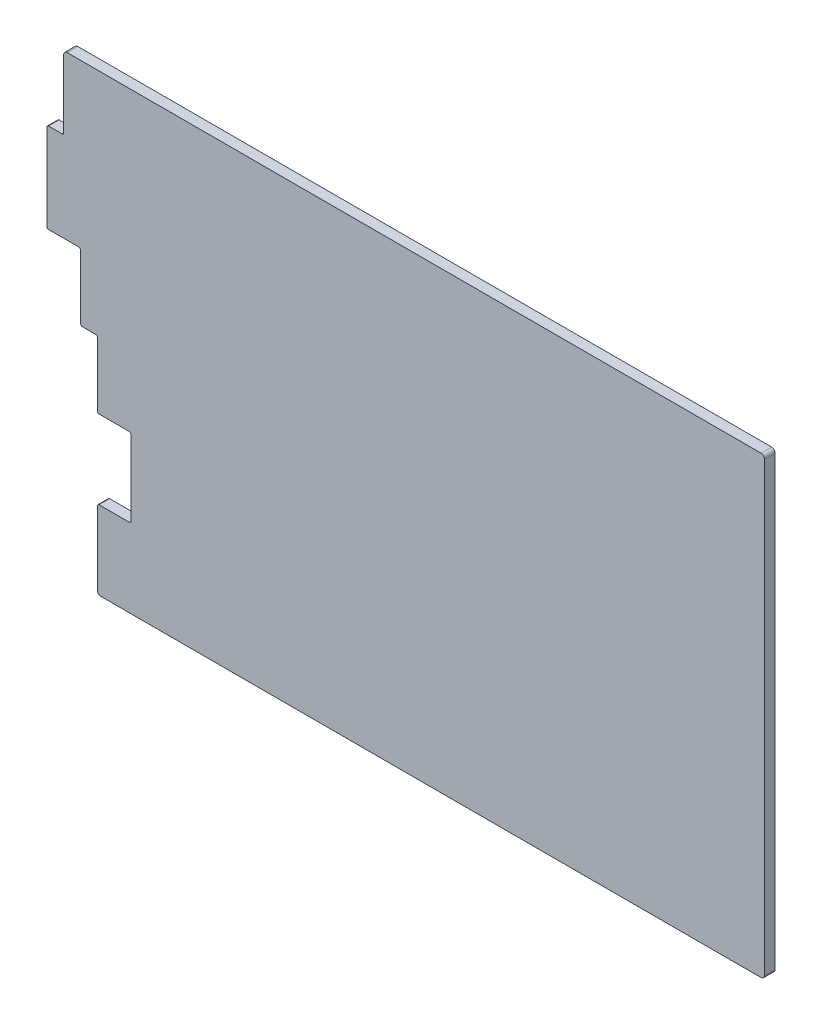
ISO-10303-21;
HEADER;
FILE_DESCRIPTION(('STEP AP214'),'2;1');
FILE_NAME('part.step','',(''),(''),'','','');
FILE_SCHEMA(('AUTOMOTIVE_DESIGN { 1 0 10303 214 1 1 1 1 }'));
ENDSEC;
DATA;
#1=APPLICATION_CONTEXT('core data for automotive mechanical design processes');
#2=APPLICATION_PROTOCOL_DEFINITION('international standard','automotive_design',2000,#1);
#3=PRODUCT_CONTEXT('',#1,'mechanical');
#4=PRODUCT('Part','Part','',(#3));
#5=PRODUCT_RELATED_PRODUCT_CATEGORY('part','',(#4));
#6=PRODUCT_DEFINITION_FORMATION('','',#4);
#7=PRODUCT_DEFINITION_CONTEXT('part definition',#1,'design');
#8=PRODUCT_DEFINITION('design','',#6,#7);
#9=PRODUCT_DEFINITION_SHAPE('','',#8);
#10=(LENGTH_UNIT() NAMED_UNIT(*) SI_UNIT(.MILLI.,.METRE.));
#11=(NAMED_UNIT(*) PLANE_ANGLE_UNIT() SI_UNIT($,.RADIAN.));
#12=(NAMED_UNIT(*) SI_UNIT($,.STERADIAN.) SOLID_ANGLE_UNIT());
#13=UNCERTAINTY_MEASURE_WITH_UNIT(LENGTH_MEASURE(1.E-05),#10,'distance_accuracy_value','');
#14=(GEOMETRIC_REPRESENTATION_CONTEXT(3) GLOBAL_UNCERTAINTY_ASSIGNED_CONTEXT((#13)) GLOBAL_UNIT_ASSIGNED_CONTEXT((#10,
#11,#12)) REPRESENTATION_CONTEXT('',''));
#15=CARTESIAN_POINT('',(0.,0.,0.));
#16=DIRECTION('',(0.,0.,1.));
#17=DIRECTION('',(1.,0.,0.));
#18=AXIS2_PLACEMENT_3D('',#15,#16,#17);
#19=CARTESIAN_POINT('',(6.45693000000005,0.,3.));
#20=DIRECTION('',(-1.,0.,0.));
#21=DIRECTION('',(0.,-1.,0.));
#22=AXIS2_PLACEMENT_3D('',#19,#20,#21);
#23=PLANE('',#22);
#24=DIRECTION('',(0.,1.,0.));
#25=VECTOR('',#24,1.);
#26=CARTESIAN_POINT('',(6.45693000000005,0.,3.));
#27=LINE('',#26,#25);
#28=CARTESIAN_POINT('',(6.45693000000002,108.871,3.));
#29=VERTEX_POINT('',#28);
#30=CARTESIAN_POINT('',(6.45693000000001,128.021,3.));
#31=VERTEX_POINT('',#30);
#32=EDGE_CURVE('E269',#29,#31,#27,.T.);
#33=ORIENTED_EDGE('',*,*,#32,.T.);
#34=DIRECTION('',(0.,0.,-1.));
#35=VECTOR('',#34,1.);
#36=CARTESIAN_POINT('',(6.45693000000001,128.021,3.));
#37=LINE('',#36,#35);
#38=CARTESIAN_POINT('',(6.45693000000001,128.021,0.));
#39=VERTEX_POINT('',#38);
#40=EDGE_CURVE('E372',#31,#39,#37,.T.);
#41=ORIENTED_EDGE('',*,*,#40,.T.);
#42=DIRECTION('',(0.,1.,0.));
#43=VECTOR('',#42,1.);
#44=CARTESIAN_POINT('',(6.45693000000005,0.,0.));
#45=LINE('',#44,#43);
#46=CARTESIAN_POINT('',(6.45693000000002,108.871,0.));
#47=VERTEX_POINT('',#46);
#48=EDGE_CURVE('E402',#47,#39,#45,.T.);
#49=ORIENTED_EDGE('',*,*,#48,.F.);
#50=DIRECTION('',(0.,0.,-1.));
#51=VECTOR('',#50,1.);
#52=CARTESIAN_POINT('',(6.45693000000002,108.871,3.));
#53=LINE('',#52,#51);
#54=EDGE_CURVE('E330',#47,#29,#53,.F.);
#55=ORIENTED_EDGE('',*,*,#54,.T.);
#56=EDGE_LOOP('',(#33,#41,#49,#55));
#57=FACE_BOUND('',#56,.T.);
#58=ADVANCED_FACE('F43',(#57),#23,.T.);
#59=CARTESIAN_POINT('',(0.,108.371,3.));
#60=DIRECTION('',(0.,1.,0.));
#61=DIRECTION('',(0.,0.,1.));
#62=AXIS2_PLACEMENT_3D('',#59,#60,#61);
#63=PLANE('',#62);
#64=DIRECTION('',(1.,0.,0.));
#65=VECTOR('',#64,1.);
#66=CARTESIAN_POINT('',(0.,108.371,0.));
#67=LINE('',#66,#65);
#68=CARTESIAN_POINT('',(2.19393000000002,108.371,0.));
#69=VERTEX_POINT('',#68);
#70=CARTESIAN_POINT('',(5.95693000000002,108.371,0.));
#71=VERTEX_POINT('',#70);
#72=EDGE_CURVE('E405',#69,#71,#67,.T.);
#73=ORIENTED_EDGE('',*,*,#72,.F.);
#74=DIRECTION('',(0.,0.,-1.));
#75=VECTOR('',#74,1.);
#76=CARTESIAN_POINT('',(2.19393000000002,108.371,3.));
#77=LINE('',#76,#75);
#78=CARTESIAN_POINT('',(2.19393000000002,108.371,3.));
#79=VERTEX_POINT('',#78);
#80=EDGE_CURVE('E328',#69,#79,#77,.F.);
#81=ORIENTED_EDGE('',*,*,#80,.T.);
#82=DIRECTION('',(1.,0.,0.));
#83=VECTOR('',#82,1.);
#84=CARTESIAN_POINT('',(0.,108.371,3.));
#85=LINE('',#84,#83);
#86=CARTESIAN_POINT('',(5.95693000000002,108.371,3.));
#87=VERTEX_POINT('',#86);
#88=EDGE_CURVE('E526',#79,#87,#85,.T.);
#89=ORIENTED_EDGE('',*,*,#88,.T.);
#90=DIRECTION('',(0.,0.,-1.));
#91=VECTOR('',#90,1.);
#92=CARTESIAN_POINT('',(5.95693000000002,108.371,0.));
#93=LINE('',#92,#91);
#94=EDGE_CURVE('E325',#87,#71,#93,.T.);
#95=ORIENTED_EDGE('',*,*,#94,.T.);
#96=EDGE_LOOP('',(#73,#81,#89,#95));
#97=FACE_BOUND('',#96,.T.);
#98=ADVANCED_FACE('F473',(#97),#63,.T.);
#99=CARTESIAN_POINT('',(1.69393000000002,0.,3.));
#100=DIRECTION('',(-1.,0.,0.));
#101=DIRECTION('',(0.,0.,1.));
#102=AXIS2_PLACEMENT_3D('',#99,#100,#101);
#103=PLANE('',#102);
#104=DIRECTION('',(0.,1.,0.));
#105=VECTOR('',#104,1.);
#106=CARTESIAN_POINT('',(1.69393000000002,0.,0.));
#107=LINE('',#106,#105);
#108=CARTESIAN_POINT('',(1.69393000000002,83.491,0.));
#109=VERTEX_POINT('',#108);
#110=CARTESIAN_POINT('',(1.69393000000002,107.871,0.));
#111=VERTEX_POINT('',#110);
#112=EDGE_CURVE('E408',#109,#111,#107,.T.);
#113=ORIENTED_EDGE('',*,*,#112,.F.);
#114=DIRECTION('',(0.,0.,-1.));
#115=VECTOR('',#114,1.);
#116=CARTESIAN_POINT('',(1.69393000000002,83.491,3.));
#117=LINE('',#116,#115);
#118=CARTESIAN_POINT('',(1.69393000000002,83.491,3.));
#119=VERTEX_POINT('',#118);
#120=EDGE_CURVE('E323',#109,#119,#117,.F.);
#121=ORIENTED_EDGE('',*,*,#120,.T.);
#122=DIRECTION('',(0.,1.,0.));
#123=VECTOR('',#122,1.);
#124=CARTESIAN_POINT('',(1.69393000000002,0.,3.));
#125=LINE('',#124,#123);
#126=CARTESIAN_POINT('',(1.69393000000002,107.871,3.));
#127=VERTEX_POINT('',#126);
#128=EDGE_CURVE('E523',#119,#127,#125,.T.);
#129=ORIENTED_EDGE('',*,*,#128,.T.);
#130=DIRECTION('',(0.,0.,-1.));
#131=VECTOR('',#130,1.);
#132=CARTESIAN_POINT('',(1.69393000000002,107.871,3.));
#133=LINE('',#132,#131);
#134=EDGE_CURVE('E320',#127,#111,#133,.T.);
#135=ORIENTED_EDGE('',*,*,#134,.T.);
#136=EDGE_LOOP('',(#113,#121,#129,#135));
#137=FACE_BOUND('',#136,.T.);
#138=ADVANCED_FACE('F480',(#137),#103,.T.);
#139=CARTESIAN_POINT('',(0.,82.991,3.));
#140=DIRECTION('',(0.,1.,0.));
#141=DIRECTION('',(0.,0.,1.));
#142=AXIS2_PLACEMENT_3D('',#139,#140,#141);
#143=PLANE('',#142);
#144=DIRECTION('',(1.,0.,0.));
#145=VECTOR('',#144,1.);
#146=CARTESIAN_POINT('',(0.,82.991,3.));
#147=LINE('',#146,#145);
#148=CARTESIAN_POINT('',(2.19393000000002,82.991,3.));
#149=VERTEX_POINT('',#148);
#150=CARTESIAN_POINT('',(10.71893,82.991,3.));
#151=VERTEX_POINT('',#150);
#152=EDGE_CURVE('E530',#149,#151,#147,.T.);
#153=ORIENTED_EDGE('',*,*,#152,.F.);
#154=DIRECTION('',(0.,0.,-1.));
#155=VECTOR('',#154,1.);
#156=CARTESIAN_POINT('',(2.19393000000002,82.991,0.));
#157=LINE('',#156,#155);
#158=CARTESIAN_POINT('',(2.19393000000002,82.991,0.));
#159=VERTEX_POINT('',#158);
#160=EDGE_CURVE('E317',#149,#159,#157,.T.);
#161=ORIENTED_EDGE('',*,*,#160,.T.);
#162=DIRECTION('',(1.,0.,0.));
#163=VECTOR('',#162,1.);
#164=CARTESIAN_POINT('',(0.,82.991,0.));
#165=LINE('',#164,#163);
#166=CARTESIAN_POINT('',(10.71893,82.991,0.));
#167=VERTEX_POINT('',#166);
#168=EDGE_CURVE('E411',#159,#167,#165,.T.);
#169=ORIENTED_EDGE('',*,*,#168,.T.);
#170=DIRECTION('',(0.,0.,-1.));
#171=VECTOR('',#170,1.);
#172=CARTESIAN_POINT('',(10.71893,82.991,3.));
#173=LINE('',#172,#171);
#174=EDGE_CURVE('E315',#167,#151,#173,.F.);
#175=ORIENTED_EDGE('',*,*,#174,.T.);
#176=EDGE_LOOP('',(#153,#161,#169,#175));
#177=FACE_BOUND('',#176,.T.);
#178=ADVANCED_FACE('F579',(#177),#143,.F.);
#179=CARTESIAN_POINT('',(11.21893,0.,3.));
#180=DIRECTION('',(1.,0.,0.));
#181=DIRECTION('',(0.,1.,0.));
#182=AXIS2_PLACEMENT_3D('',#179,#180,#181);
#183=PLANE('',#182);
#184=DIRECTION('',(0.,-1.,0.));
#185=VECTOR('',#184,1.);
#186=CARTESIAN_POINT('',(11.21893,0.,0.));
#187=LINE('',#186,#185);
#188=CARTESIAN_POINT('',(11.21893,82.491,0.));
#189=VERTEX_POINT('',#188);
#190=CARTESIAN_POINT('',(11.21893,64.441,0.));
#191=VERTEX_POINT('',#190);
#192=EDGE_CURVE('E414',#189,#191,#187,.T.);
#193=ORIENTED_EDGE('',*,*,#192,.T.);
#194=DIRECTION('',(0.,0.,-1.));
#195=VECTOR('',#194,1.);
#196=CARTESIAN_POINT('',(11.21893,64.441,3.));
#197=LINE('',#196,#195);
#198=CARTESIAN_POINT('',(11.21893,64.441,3.));
#199=VERTEX_POINT('',#198);
#200=EDGE_CURVE('E313',#191,#199,#197,.F.);
#201=ORIENTED_EDGE('',*,*,#200,.T.);
#202=DIRECTION('',(0.,-1.,0.));
#203=VECTOR('',#202,1.);
#204=CARTESIAN_POINT('',(11.21893,0.,3.));
#205=LINE('',#204,#203);
#206=CARTESIAN_POINT('',(11.21893,82.491,3.));
#207=VERTEX_POINT('',#206);
#208=EDGE_CURVE('E533',#207,#199,#205,.T.);
#209=ORIENTED_EDGE('',*,*,#208,.F.);
#210=DIRECTION('',(0.,0.,-1.));
#211=VECTOR('',#210,1.);
#212=CARTESIAN_POINT('',(11.21893,82.491,0.));
#213=LINE('',#212,#211);
#214=EDGE_CURVE('E310',#207,#189,#213,.T.);
#215=ORIENTED_EDGE('',*,*,#214,.T.);
#216=EDGE_LOOP('',(#193,#201,#209,#215));
#217=FACE_BOUND('',#216,.T.);
#218=ADVANCED_FACE('F571',(#217),#183,.F.);
#219=CARTESIAN_POINT('',(0.,63.941,3.));
#220=DIRECTION('',(0.,1.,0.));
#221=DIRECTION('',(0.,0.,1.));
#222=AXIS2_PLACEMENT_3D('',#219,#220,#221);
#223=PLANE('',#222);
#224=DIRECTION('',(1.,0.,0.));
#225=VECTOR('',#224,1.);
#226=CARTESIAN_POINT('',(0.,63.941,0.));
#227=LINE('',#226,#225);
#228=CARTESIAN_POINT('',(11.71893,63.941,0.));
#229=VERTEX_POINT('',#228);
#230=CARTESIAN_POINT('',(15.48193,63.941,0.));
#231=VERTEX_POINT('',#230);
#232=EDGE_CURVE('E417',#229,#231,#227,.T.);
#233=ORIENTED_EDGE('',*,*,#232,.T.);
#234=DIRECTION('',(0.,0.,-1.));
#235=VECTOR('',#234,1.);
#236=CARTESIAN_POINT('',(15.48193,63.941,3.));
#237=LINE('',#236,#235);
#238=CARTESIAN_POINT('',(15.48193,63.941,3.));
#239=VERTEX_POINT('',#238);
#240=EDGE_CURVE('E308',#231,#239,#237,.F.);
#241=ORIENTED_EDGE('',*,*,#240,.T.);
#242=DIRECTION('',(1.,0.,0.));
#243=VECTOR('',#242,1.);
#244=CARTESIAN_POINT('',(0.,63.941,3.));
#245=LINE('',#244,#243);
#246=CARTESIAN_POINT('',(11.71893,63.941,3.));
#247=VERTEX_POINT('',#246);
#248=EDGE_CURVE('E540',#247,#239,#245,.T.);
#249=ORIENTED_EDGE('',*,*,#248,.F.);
#250=DIRECTION('',(0.,0.,-1.));
#251=VECTOR('',#250,1.);
#252=CARTESIAN_POINT('',(11.71893,63.941,3.));
#253=LINE('',#252,#251);
#254=EDGE_CURVE('E305',#247,#229,#253,.T.);
#255=ORIENTED_EDGE('',*,*,#254,.T.);
#256=EDGE_LOOP('',(#233,#241,#249,#255));
#257=FACE_BOUND('',#256,.T.);
#258=ADVANCED_FACE('F564',(#257),#223,.F.);
#259=CARTESIAN_POINT('',(15.98193,0.,3.));
#260=DIRECTION('',(1.,0.,0.));
#261=DIRECTION('',(0.,1.,0.));
#262=AXIS2_PLACEMENT_3D('',#259,#260,#261);
#263=PLANE('',#262);
#264=DIRECTION('',(0.,-1.,0.));
#265=VECTOR('',#264,1.);
#266=CARTESIAN_POINT('',(15.98193,0.,0.));
#267=LINE('',#266,#265);
#268=CARTESIAN_POINT('',(15.98193,63.441,0.));
#269=VERTEX_POINT('',#268);
#270=CARTESIAN_POINT('',(15.98193,45.391,0.));
#271=VERTEX_POINT('',#270);
#272=EDGE_CURVE('E420',#269,#271,#267,.T.);
#273=ORIENTED_EDGE('',*,*,#272,.T.);
#274=DIRECTION('',(0.,0.,-1.));
#275=VECTOR('',#274,1.);
#276=CARTESIAN_POINT('',(15.98193,45.391,3.));
#277=LINE('',#276,#275);
#278=CARTESIAN_POINT('',(15.98193,45.391,3.));
#279=VERTEX_POINT('',#278);
#280=EDGE_CURVE('E303',#271,#279,#277,.F.);
#281=ORIENTED_EDGE('',*,*,#280,.T.);
#282=DIRECTION('',(0.,-1.,0.));
#283=VECTOR('',#282,1.);
#284=CARTESIAN_POINT('',(15.98193,0.,3.));
#285=LINE('',#284,#283);
#286=CARTESIAN_POINT('',(15.98193,63.441,3.));
#287=VERTEX_POINT('',#286);
#288=EDGE_CURVE('E543',#287,#279,#285,.T.);
#289=ORIENTED_EDGE('',*,*,#288,.F.);
#290=DIRECTION('',(0.,0.,-1.));
#291=VECTOR('',#290,1.);
#292=CARTESIAN_POINT('',(15.98193,63.441,0.));
#293=LINE('',#292,#291);
#294=EDGE_CURVE('E300',#287,#269,#293,.T.);
#295=ORIENTED_EDGE('',*,*,#294,.T.);
#296=EDGE_LOOP('',(#273,#281,#289,#295));
#297=FACE_BOUND('',#296,.T.);
#298=ADVANCED_FACE('F557',(#297),#263,.F.);
#299=CARTESIAN_POINT('',(0.,44.891,3.));
#300=DIRECTION('',(0.,1.,0.));
#301=DIRECTION('',(0.,0.,1.));
#302=AXIS2_PLACEMENT_3D('',#299,#300,#301);
#303=PLANE('',#302);
#304=DIRECTION('',(1.,0.,0.));
#305=VECTOR('',#304,1.);
#306=CARTESIAN_POINT('',(0.,44.891,3.));
#307=LINE('',#306,#305);
#308=CARTESIAN_POINT('',(16.48193,44.891,3.));
#309=VERTEX_POINT('',#308);
#310=CARTESIAN_POINT('',(25.00693,44.891,3.));
#311=VERTEX_POINT('',#310);
#312=EDGE_CURVE('E446',#309,#311,#307,.T.);
#313=ORIENTED_EDGE('',*,*,#312,.F.);
#314=DIRECTION('',(0.,0.,-1.));
#315=VECTOR('',#314,1.);
#316=CARTESIAN_POINT('',(16.48193,44.891,3.));
#317=LINE('',#316,#315);
#318=CARTESIAN_POINT('',(16.48193,44.891,0.));
#319=VERTEX_POINT('',#318);
#320=EDGE_CURVE('E297',#309,#319,#317,.T.);
#321=ORIENTED_EDGE('',*,*,#320,.T.);
#322=DIRECTION('',(1.,0.,0.));
#323=VECTOR('',#322,1.);
#324=CARTESIAN_POINT('',(0.,44.891,0.));
#325=LINE('',#324,#323);
#326=CARTESIAN_POINT('',(25.00693,44.891,0.));
#327=VERTEX_POINT('',#326);
#328=EDGE_CURVE('E423',#319,#327,#325,.T.);
#329=ORIENTED_EDGE('',*,*,#328,.T.);
#330=DIRECTION('',(0.,0.,-1.));
#331=VECTOR('',#330,1.);
#332=CARTESIAN_POINT('',(25.00693,44.891,3.));
#333=LINE('',#332,#331);
#334=EDGE_CURVE('E295',#327,#311,#333,.F.);
#335=ORIENTED_EDGE('',*,*,#334,.T.);
#336=EDGE_LOOP('',(#313,#321,#329,#335));
#337=FACE_BOUND('',#336,.T.);
#338=ADVANCED_FACE('F553',(#337),#303,.F.);
#339=CARTESIAN_POINT('',(25.50693,0.,3.));
#340=DIRECTION('',(1.,0.,0.));
#341=DIRECTION('',(0.,1.,0.));
#342=AXIS2_PLACEMENT_3D('',#339,#340,#341);
#343=PLANE('',#342);
#344=DIRECTION('',(0.,-1.,0.));
#345=VECTOR('',#344,1.);
#346=CARTESIAN_POINT('',(25.50693,0.,0.));
#347=LINE('',#346,#345);
#348=CARTESIAN_POINT('',(25.50693,44.391,0.));
#349=VERTEX_POINT('',#348);
#350=CARTESIAN_POINT('',(25.50693,23.141,0.));
#351=VERTEX_POINT('',#350);
#352=EDGE_CURVE('E261',#349,#351,#347,.T.);
#353=ORIENTED_EDGE('',*,*,#352,.T.);
#354=DIRECTION('',(0.,0.,-1.));
#355=VECTOR('',#354,1.);
#356=CARTESIAN_POINT('',(25.50693,23.141,3.));
#357=LINE('',#356,#355);
#358=CARTESIAN_POINT('',(25.50693,23.141,3.));
#359=VERTEX_POINT('',#358);
#360=EDGE_CURVE('E293',#351,#359,#357,.F.);
#361=ORIENTED_EDGE('',*,*,#360,.T.);
#362=DIRECTION('',(0.,-1.,0.));
#363=VECTOR('',#362,1.);
#364=CARTESIAN_POINT('',(25.50693,0.,3.));
#365=LINE('',#364,#363);
#366=CARTESIAN_POINT('',(25.50693,44.391,3.));
#367=VERTEX_POINT('',#366);
#368=EDGE_CURVE('E441',#367,#359,#365,.T.);
#369=ORIENTED_EDGE('',*,*,#368,.F.);
#370=DIRECTION('',(0.,0.,-1.));
#371=VECTOR('',#370,1.);
#372=CARTESIAN_POINT('',(25.50693,44.391,0.));
#373=LINE('',#372,#371);
#374=EDGE_CURVE('E290',#367,#349,#373,.T.);
#375=ORIENTED_EDGE('',*,*,#374,.T.);
#376=EDGE_LOOP('',(#353,#361,#369,#375));
#377=FACE_BOUND('',#376,.T.);
#378=ADVANCED_FACE('F429',(#377),#343,.F.);
#379=CARTESIAN_POINT('',(0.,22.641,3.));
#380=DIRECTION('',(0.,-1.,0.));
#381=DIRECTION('',(0.,0.,-1.));
#382=AXIS2_PLACEMENT_3D('',#379,#380,#381);
#383=PLANE('',#382);
#384=DIRECTION('',(-1.,0.,0.));
#385=VECTOR('',#384,1.);
#386=CARTESIAN_POINT('',(0.,22.641,0.));
#387=LINE('',#386,#385);
#388=CARTESIAN_POINT('',(25.00693,22.641,0.));
#389=VERTEX_POINT('',#388);
#390=CARTESIAN_POINT('',(16.48193,22.641,0.));
#391=VERTEX_POINT('',#390);
#392=EDGE_CURVE('E257',#389,#391,#387,.T.);
#393=ORIENTED_EDGE('',*,*,#392,.T.);
#394=DIRECTION('',(0.,0.,-1.));
#395=VECTOR('',#394,1.);
#396=CARTESIAN_POINT('',(16.48193,22.641,3.));
#397=LINE('',#396,#395);
#398=CARTESIAN_POINT('',(16.48193,22.641,3.));
#399=VERTEX_POINT('',#398);
#400=EDGE_CURVE('E234',#391,#399,#397,.F.);
#401=ORIENTED_EDGE('',*,*,#400,.T.);
#402=DIRECTION('',(-1.,0.,0.));
#403=VECTOR('',#402,1.);
#404=CARTESIAN_POINT('',(0.,22.641,3.));
#405=LINE('',#404,#403);
#406=CARTESIAN_POINT('',(25.00693,22.641,3.));
#407=VERTEX_POINT('',#406);
#408=EDGE_CURVE('E440',#407,#399,#405,.T.);
#409=ORIENTED_EDGE('',*,*,#408,.F.);
#410=DIRECTION('',(0.,0.,-1.));
#411=VECTOR('',#410,1.);
#412=CARTESIAN_POINT('',(25.00693,22.641,0.));
#413=LINE('',#412,#411);
#414=EDGE_CURVE('E239',#407,#389,#413,.T.);
#415=ORIENTED_EDGE('',*,*,#414,.T.);
#416=EDGE_LOOP('',(#393,#401,#409,#415));
#417=FACE_BOUND('',#416,.T.);
#418=ADVANCED_FACE('F443',(#417),#383,.F.);
#419=CARTESIAN_POINT('',(15.98193,0.,3.));
#420=DIRECTION('',(1.,0.,0.));
#421=DIRECTION('',(0.,1.,0.));
#422=AXIS2_PLACEMENT_3D('',#419,#420,#421);
#423=PLANE('',#422);
#424=DIRECTION('',(0.,-1.,0.));
#425=VECTOR('',#424,1.);
#426=CARTESIAN_POINT('',(15.98193,0.,0.));
#427=LINE('',#426,#425);
#428=CARTESIAN_POINT('',(15.98193,22.141,0.));
#429=VERTEX_POINT('',#428);
#430=CARTESIAN_POINT('',(15.98193,1.434082,0.));
#431=VERTEX_POINT('',#430);
#432=EDGE_CURVE('E246',#429,#431,#427,.T.);
#433=ORIENTED_EDGE('',*,*,#432,.T.);
#434=DIRECTION('',(0.,0.,-1.));
#435=VECTOR('',#434,1.);
#436=CARTESIAN_POINT('',(15.98193,1.434082,3.));
#437=LINE('',#436,#435);
#438=CARTESIAN_POINT('',(15.98193,1.434082,3.));
#439=VERTEX_POINT('',#438);
#440=EDGE_CURVE('E364',#431,#439,#437,.F.);
#441=ORIENTED_EDGE('',*,*,#440,.T.);
#442=DIRECTION('',(0.,-1.,0.));
#443=VECTOR('',#442,1.);
#444=CARTESIAN_POINT('',(15.98193,0.,3.));
#445=LINE('',#444,#443);
#446=CARTESIAN_POINT('',(15.98193,22.141,3.));
#447=VERTEX_POINT('',#446);
#448=EDGE_CURVE('E249',#447,#439,#445,.T.);
#449=ORIENTED_EDGE('',*,*,#448,.F.);
#450=DIRECTION('',(0.,0.,-1.));
#451=VECTOR('',#450,1.);
#452=CARTESIAN_POINT('',(15.98193,22.141,3.));
#453=LINE('',#452,#451);
#454=EDGE_CURVE('E233',#447,#429,#453,.T.);
#455=ORIENTED_EDGE('',*,*,#454,.T.);
#456=EDGE_LOOP('',(#433,#441,#449,#455));
#457=FACE_BOUND('',#456,.T.);
#458=ADVANCED_FACE('F245',(#457),#423,.F.);
#459=CARTESIAN_POINT('',(0.,0.434082,3.));
#460=DIRECTION('',(0.,-1.,0.));
#461=DIRECTION('',(0.,0.,-1.));
#462=AXIS2_PLACEMENT_3D('',#459,#460,#461);
#463=PLANE('',#462);
#464=DIRECTION('',(-1.,0.,0.));
#465=VECTOR('',#464,1.);
#466=CARTESIAN_POINT('',(0.,0.434082,3.));
#467=LINE('',#466,#465);
#468=CARTESIAN_POINT('',(203.883,0.434082,3.));
#469=VERTEX_POINT('',#468);
#470=CARTESIAN_POINT('',(16.98193,0.434082,3.));
#471=VERTEX_POINT('',#470);
#472=EDGE_CURVE('E398',#469,#471,#467,.T.);
#473=ORIENTED_EDGE('',*,*,#472,.T.);
#474=DIRECTION('',(0.,0.,-1.));
#475=VECTOR('',#474,1.);
#476=CARTESIAN_POINT('',(16.98193,0.434082,0.));
#477=LINE('',#476,#475);
#478=CARTESIAN_POINT('',(16.98193,0.434082,0.));
#479=VERTEX_POINT('',#478);
#480=EDGE_CURVE('E354',#471,#479,#477,.T.);
#481=ORIENTED_EDGE('',*,*,#480,.T.);
#482=DIRECTION('',(-1.,0.,0.));
#483=VECTOR('',#482,1.);
#484=CARTESIAN_POINT('',(0.,0.434082,0.));
#485=LINE('',#484,#483);
#486=CARTESIAN_POINT('',(203.883,0.434082,0.));
#487=VERTEX_POINT('',#486);
#488=EDGE_CURVE('E256',#487,#479,#485,.T.);
#489=ORIENTED_EDGE('',*,*,#488,.F.);
#490=DIRECTION('',(0.,0.,-1.));
#491=VECTOR('',#490,1.);
#492=CARTESIAN_POINT('',(203.883,0.434082,3.));
#493=LINE('',#492,#491);
#494=EDGE_CURVE('E352',#487,#469,#493,.F.);
#495=ORIENTED_EDGE('',*,*,#494,.T.);
#496=EDGE_LOOP('',(#473,#481,#489,#495));
#497=FACE_BOUND('',#496,.T.);
#498=ADVANCED_FACE('F453',(#497),#463,.T.);
#499=CARTESIAN_POINT('',(204.883,0.,3.));
#500=DIRECTION('',(1.,0.,0.));
#501=DIRECTION('',(0.,0.,-1.));
#502=AXIS2_PLACEMENT_3D('',#499,#500,#501);
#503=PLANE('',#502);
#504=DIRECTION('',(0.,-1.,0.));
#505=VECTOR('',#504,1.);
#506=CARTESIAN_POINT('',(204.883,0.,0.));
#507=LINE('',#506,#505);
#508=CARTESIAN_POINT('',(204.883,128.021,0.));
#509=VERTEX_POINT('',#508);
#510=CARTESIAN_POINT('',(204.883,1.434082,0.));
#511=VERTEX_POINT('',#510);
#512=EDGE_CURVE('E259',#509,#511,#507,.T.);
#513=ORIENTED_EDGE('',*,*,#512,.F.);
#514=DIRECTION('',(0.,0.,-1.));
#515=VECTOR('',#514,1.);
#516=CARTESIAN_POINT('',(204.883,128.021,3.));
#517=LINE('',#516,#515);
#518=CARTESIAN_POINT('',(204.883,128.021,3.));
#519=VERTEX_POINT('',#518);
#520=EDGE_CURVE('E11',#509,#519,#517,.F.);
#521=ORIENTED_EDGE('',*,*,#520,.T.);
#522=DIRECTION('',(0.,-1.,0.));
#523=VECTOR('',#522,1.);
#524=CARTESIAN_POINT('',(204.883,0.,3.));
#525=LINE('',#524,#523);
#526=CARTESIAN_POINT('',(204.883,1.434082,3.));
#527=VERTEX_POINT('',#526);
#528=EDGE_CURVE('E386',#519,#527,#525,.T.);
#529=ORIENTED_EDGE('',*,*,#528,.T.);
#530=DIRECTION('',(0.,0.,-1.));
#531=VECTOR('',#530,1.);
#532=CARTESIAN_POINT('',(204.883,1.434082,3.));
#533=LINE('',#532,#531);
#534=EDGE_CURVE('E51',#527,#511,#533,.T.);
#535=ORIENTED_EDGE('',*,*,#534,.T.);
#536=EDGE_LOOP('',(#513,#521,#529,#535));
#537=FACE_BOUND('',#536,.T.);
#538=ADVANCED_FACE('F384',(#537),#503,.T.);
#539=CARTESIAN_POINT('',(0.,129.021,3.));
#540=DIRECTION('',(0.,1.,0.));
#541=DIRECTION('',(0.,0.,1.));
#542=AXIS2_PLACEMENT_3D('',#539,#540,#541);
#543=PLANE('',#542);
#544=DIRECTION('',(1.,0.,0.));
#545=VECTOR('',#544,1.);
#546=CARTESIAN_POINT('',(0.,129.021,0.));
#547=LINE('',#546,#545);
#548=CARTESIAN_POINT('',(7.45693000000001,129.021,0.));
#549=VERTEX_POINT('',#548);
#550=CARTESIAN_POINT('',(203.883,129.021,0.));
#551=VERTEX_POINT('',#550);
#552=EDGE_CURVE('E267',#549,#551,#547,.T.);
#553=ORIENTED_EDGE('',*,*,#552,.F.);
#554=DIRECTION('',(0.,0.,-1.));
#555=VECTOR('',#554,1.);
#556=CARTESIAN_POINT('',(7.45693000000001,129.021,3.));
#557=LINE('',#556,#555);
#558=CARTESIAN_POINT('',(7.45693000000001,129.021,3.));
#559=VERTEX_POINT('',#558);
#560=EDGE_CURVE('E378',#549,#559,#557,.F.);
#561=ORIENTED_EDGE('',*,*,#560,.T.);
#562=DIRECTION('',(1.,0.,0.));
#563=VECTOR('',#562,1.);
#564=CARTESIAN_POINT('',(0.,129.021,3.));
#565=LINE('',#564,#563);
#566=CARTESIAN_POINT('',(203.883,129.021,3.));
#567=VERTEX_POINT('',#566);
#568=EDGE_CURVE('E251',#559,#567,#565,.T.);
#569=ORIENTED_EDGE('',*,*,#568,.T.);
#570=DIRECTION('',(0.,0.,-1.));
#571=VECTOR('',#570,1.);
#572=CARTESIAN_POINT('',(203.883,129.021,3.));
#573=LINE('',#572,#571);
#574=EDGE_CURVE('E375',#567,#551,#573,.T.);
#575=ORIENTED_EDGE('',*,*,#574,.T.);
#576=EDGE_LOOP('',(#553,#561,#569,#575));
#577=FACE_BOUND('',#576,.T.);
#578=ADVANCED_FACE('F395',(#577),#543,.T.);
#579=CARTESIAN_POINT('',(0.,0.,3.));
#580=DIRECTION('',(0.,0.,1.));
#581=DIRECTION('',(1.,0.,0.));
#582=AXIS2_PLACEMENT_3D('',#579,#580,#581);
#583=PLANE('',#582);
#584=ORIENTED_EDGE('',*,*,#448,.T.);
#585=CARTESIAN_POINT('',(16.98193,1.434082,3.));
#586=DIRECTION('',(0.,0.,1.));
#587=DIRECTION('',(1.,0.,0.));
#588=AXIS2_PLACEMENT_3D('',#585,#586,#587);
#589=CIRCLE('',#588,1.);
#590=EDGE_CURVE('E370',#439,#471,#589,.T.);
#591=ORIENTED_EDGE('',*,*,#590,.T.);
#592=ORIENTED_EDGE('',*,*,#472,.F.);
#593=CARTESIAN_POINT('',(203.883,1.434082,3.));
#594=DIRECTION('',(0.,0.,1.));
#595=DIRECTION('',(1.,0.,0.));
#596=AXIS2_PLACEMENT_3D('',#593,#594,#595);
#597=CIRCLE('',#596,1.);
#598=EDGE_CURVE('E366',#469,#527,#597,.T.);
#599=ORIENTED_EDGE('',*,*,#598,.T.);
#600=ORIENTED_EDGE('',*,*,#528,.F.);
#601=CARTESIAN_POINT('',(203.883,128.021,3.));
#602=DIRECTION('',(0.,0.,1.));
#603=DIRECTION('',(1.,0.,0.));
#604=AXIS2_PLACEMENT_3D('',#601,#602,#603);
#605=CIRCLE('',#604,1.);
#606=EDGE_CURVE('E64',#519,#567,#605,.T.);
#607=ORIENTED_EDGE('',*,*,#606,.T.);
#608=ORIENTED_EDGE('',*,*,#568,.F.);
#609=CARTESIAN_POINT('',(7.45693000000001,128.021,3.));
#610=DIRECTION('',(0.,0.,1.));
#611=DIRECTION('',(1.,0.,0.));
#612=AXIS2_PLACEMENT_3D('',#609,#610,#611);
#613=CIRCLE('',#612,1.);
#614=EDGE_CURVE('E58',#559,#31,#613,.T.);
#615=ORIENTED_EDGE('',*,*,#614,.T.);
#616=ORIENTED_EDGE('',*,*,#32,.F.);
#617=CARTESIAN_POINT('',(5.95693000000002,108.871,3.));
#618=DIRECTION('',(0.,0.,1.));
#619=DIRECTION('',(1.,0.,0.));
#620=AXIS2_PLACEMENT_3D('',#617,#618,#619);
#621=CIRCLE('',#620,0.5);
#622=EDGE_CURVE('E350',#29,#87,#621,.F.);
#623=ORIENTED_EDGE('',*,*,#622,.T.);
#624=ORIENTED_EDGE('',*,*,#88,.F.);
#625=CARTESIAN_POINT('',(2.19393000000002,107.871,3.));
#626=DIRECTION('',(0.,0.,1.));
#627=DIRECTION('',(1.,0.,0.));
#628=AXIS2_PLACEMENT_3D('',#625,#626,#627);
#629=CIRCLE('',#628,0.5);
#630=EDGE_CURVE('E280',#79,#127,#629,.T.);
#631=ORIENTED_EDGE('',*,*,#630,.T.);
#632=ORIENTED_EDGE('',*,*,#128,.F.);
#633=CARTESIAN_POINT('',(2.19393000000002,83.491,3.));
#634=DIRECTION('',(0.,0.,1.));
#635=DIRECTION('',(1.,0.,0.));
#636=AXIS2_PLACEMENT_3D('',#633,#634,#635);
#637=CIRCLE('',#636,0.5);
#638=EDGE_CURVE('E282',#119,#149,#637,.T.);
#639=ORIENTED_EDGE('',*,*,#638,.T.);
#640=ORIENTED_EDGE('',*,*,#152,.T.);
#641=CARTESIAN_POINT('',(10.71893,82.491,3.));
#642=DIRECTION('',(0.,0.,1.));
#643=DIRECTION('',(1.,0.,0.));
#644=AXIS2_PLACEMENT_3D('',#641,#642,#643);
#645=CIRCLE('',#644,0.5);
#646=EDGE_CURVE('E346',#151,#207,#645,.F.);
#647=ORIENTED_EDGE('',*,*,#646,.T.);
#648=ORIENTED_EDGE('',*,*,#208,.T.);
#649=CARTESIAN_POINT('',(11.71893,64.441,3.));
#650=DIRECTION('',(0.,0.,1.));
#651=DIRECTION('',(1.,0.,0.));
#652=AXIS2_PLACEMENT_3D('',#649,#650,#651);
#653=CIRCLE('',#652,0.5);
#654=EDGE_CURVE('E284',#199,#247,#653,.T.);
#655=ORIENTED_EDGE('',*,*,#654,.T.);
#656=ORIENTED_EDGE('',*,*,#248,.T.);
#657=CARTESIAN_POINT('',(15.48193,63.441,3.));
#658=DIRECTION('',(0.,0.,1.));
#659=DIRECTION('',(1.,0.,0.));
#660=AXIS2_PLACEMENT_3D('',#657,#658,#659);
#661=CIRCLE('',#660,0.5);
#662=EDGE_CURVE('E342',#239,#287,#661,.F.);
#663=ORIENTED_EDGE('',*,*,#662,.T.);
#664=ORIENTED_EDGE('',*,*,#288,.T.);
#665=CARTESIAN_POINT('',(16.48193,45.391,3.));
#666=DIRECTION('',(0.,0.,1.));
#667=DIRECTION('',(1.,0.,0.));
#668=AXIS2_PLACEMENT_3D('',#665,#666,#667);
#669=CIRCLE('',#668,0.5);
#670=EDGE_CURVE('E286',#279,#309,#669,.T.);
#671=ORIENTED_EDGE('',*,*,#670,.T.);
#672=ORIENTED_EDGE('',*,*,#312,.T.);
#673=CARTESIAN_POINT('',(25.00693,44.391,3.));
#674=DIRECTION('',(0.,0.,1.));
#675=DIRECTION('',(1.,0.,0.));
#676=AXIS2_PLACEMENT_3D('',#673,#674,#675);
#677=CIRCLE('',#676,0.5);
#678=EDGE_CURVE('E338',#311,#367,#677,.F.);
#679=ORIENTED_EDGE('',*,*,#678,.T.);
#680=ORIENTED_EDGE('',*,*,#368,.T.);
#681=CARTESIAN_POINT('',(25.00693,23.141,3.));
#682=DIRECTION('',(0.,0.,1.));
#683=DIRECTION('',(1.,0.,0.));
#684=AXIS2_PLACEMENT_3D('',#681,#682,#683);
#685=CIRCLE('',#684,0.5);
#686=EDGE_CURVE('E334',#359,#407,#685,.F.);
#687=ORIENTED_EDGE('',*,*,#686,.T.);
#688=ORIENTED_EDGE('',*,*,#408,.T.);
#689=CARTESIAN_POINT('',(16.48193,22.141,3.));
#690=DIRECTION('',(0.,0.,1.));
#691=DIRECTION('',(1.,0.,0.));
#692=AXIS2_PLACEMENT_3D('',#689,#690,#691);
#693=CIRCLE('',#692,0.5);
#694=EDGE_CURVE('E288',#399,#447,#693,.T.);
#695=ORIENTED_EDGE('',*,*,#694,.T.);
#696=EDGE_LOOP('',(#584,#591,#592,#599,#600,#607,#608,#615,#616,#623,#624,#631,#632,#639,#640,
#647,#648,#655,#656,#663,#664,#671,#672,#679,#680,#687,#688,#695));
#697=FACE_BOUND('',#696,.T.);
#698=ADVANCED_FACE('F439',(#697),#583,.T.);
#699=CARTESIAN_POINT('',(0.,0.,0.));
#700=DIRECTION('',(0.,0.,1.));
#701=DIRECTION('',(1.,0.,0.));
#702=AXIS2_PLACEMENT_3D('',#699,#700,#701);
#703=PLANE('',#702);
#704=ORIENTED_EDGE('',*,*,#488,.T.);
#705=CARTESIAN_POINT('',(16.98193,1.434082,0.));
#706=DIRECTION('',(0.,0.,1.));
#707=DIRECTION('',(1.,0.,0.));
#708=AXIS2_PLACEMENT_3D('',#705,#706,#707);
#709=CIRCLE('',#708,1.);
#710=EDGE_CURVE('E255',#479,#431,#709,.F.);
#711=ORIENTED_EDGE('',*,*,#710,.T.);
#712=ORIENTED_EDGE('',*,*,#432,.F.);
#713=CARTESIAN_POINT('',(16.48193,22.141,0.));
#714=DIRECTION('',(0.,0.,1.));
#715=DIRECTION('',(1.,0.,0.));
#716=AXIS2_PLACEMENT_3D('',#713,#714,#715);
#717=CIRCLE('',#716,0.5);
#718=EDGE_CURVE('E229',#429,#391,#717,.F.);
#719=ORIENTED_EDGE('',*,*,#718,.T.);
#720=ORIENTED_EDGE('',*,*,#392,.F.);
#721=CARTESIAN_POINT('',(25.00693,23.141,0.));
#722=DIRECTION('',(0.,0.,1.));
#723=DIRECTION('',(1.,0.,0.));
#724=AXIS2_PLACEMENT_3D('',#721,#722,#723);
#725=CIRCLE('',#724,0.5);
#726=EDGE_CURVE('E332',#389,#351,#725,.T.);
#727=ORIENTED_EDGE('',*,*,#726,.T.);
#728=ORIENTED_EDGE('',*,*,#352,.F.);
#729=CARTESIAN_POINT('',(25.00693,44.391,0.));
#730=DIRECTION('',(0.,0.,1.));
#731=DIRECTION('',(1.,0.,0.));
#732=AXIS2_PLACEMENT_3D('',#729,#730,#731);
#733=CIRCLE('',#732,0.5);
#734=EDGE_CURVE('E336',#349,#327,#733,.T.);
#735=ORIENTED_EDGE('',*,*,#734,.T.);
#736=ORIENTED_EDGE('',*,*,#328,.F.);
#737=CARTESIAN_POINT('',(16.48193,45.391,0.));
#738=DIRECTION('',(0.,0.,1.));
#739=DIRECTION('',(1.,0.,0.));
#740=AXIS2_PLACEMENT_3D('',#737,#738,#739);
#741=CIRCLE('',#740,0.5);
#742=EDGE_CURVE('E240',#319,#271,#741,.F.);
#743=ORIENTED_EDGE('',*,*,#742,.T.);
#744=ORIENTED_EDGE('',*,*,#272,.F.);
#745=CARTESIAN_POINT('',(15.48193,63.441,0.));
#746=DIRECTION('',(0.,0.,1.));
#747=DIRECTION('',(1.,0.,0.));
#748=AXIS2_PLACEMENT_3D('',#745,#746,#747);
#749=CIRCLE('',#748,0.5);
#750=EDGE_CURVE('E340',#269,#231,#749,.T.);
#751=ORIENTED_EDGE('',*,*,#750,.T.);
#752=ORIENTED_EDGE('',*,*,#232,.F.);
#753=CARTESIAN_POINT('',(11.71893,64.441,0.));
#754=DIRECTION('',(0.,0.,1.));
#755=DIRECTION('',(1.,0.,0.));
#756=AXIS2_PLACEMENT_3D('',#753,#754,#755);
#757=CIRCLE('',#756,0.5);
#758=EDGE_CURVE('E274',#229,#191,#757,.F.);
#759=ORIENTED_EDGE('',*,*,#758,.T.);
#760=ORIENTED_EDGE('',*,*,#192,.F.);
#761=CARTESIAN_POINT('',(10.71893,82.491,0.));
#762=DIRECTION('',(0.,0.,1.));
#763=DIRECTION('',(1.,0.,0.));
#764=AXIS2_PLACEMENT_3D('',#761,#762,#763);
#765=CIRCLE('',#764,0.5);
#766=EDGE_CURVE('E344',#189,#167,#765,.T.);
#767=ORIENTED_EDGE('',*,*,#766,.T.);
#768=ORIENTED_EDGE('',*,*,#168,.F.);
#769=CARTESIAN_POINT('',(2.19393000000002,83.491,0.));
#770=DIRECTION('',(0.,0.,1.));
#771=DIRECTION('',(1.,0.,0.));
#772=AXIS2_PLACEMENT_3D('',#769,#770,#771);
#773=CIRCLE('',#772,0.5);
#774=EDGE_CURVE('E272',#159,#109,#773,.F.);
#775=ORIENTED_EDGE('',*,*,#774,.T.);
#776=ORIENTED_EDGE('',*,*,#112,.T.);
#777=CARTESIAN_POINT('',(2.19393000000002,107.871,0.));
#778=DIRECTION('',(0.,0.,1.));
#779=DIRECTION('',(1.,0.,0.));
#780=AXIS2_PLACEMENT_3D('',#777,#778,#779);
#781=CIRCLE('',#780,0.5);
#782=EDGE_CURVE('E250',#111,#69,#781,.F.);
#783=ORIENTED_EDGE('',*,*,#782,.T.);
#784=ORIENTED_EDGE('',*,*,#72,.T.);
#785=CARTESIAN_POINT('',(5.95693000000002,108.871,0.));
#786=DIRECTION('',(0.,0.,1.));
#787=DIRECTION('',(1.,0.,0.));
#788=AXIS2_PLACEMENT_3D('',#785,#786,#787);
#789=CIRCLE('',#788,0.5);
#790=EDGE_CURVE('E348',#71,#47,#789,.T.);
#791=ORIENTED_EDGE('',*,*,#790,.T.);
#792=ORIENTED_EDGE('',*,*,#48,.T.);
#793=CARTESIAN_POINT('',(7.45693000000001,128.021,0.));
#794=DIRECTION('',(0.,0.,1.));
#795=DIRECTION('',(1.,0.,0.));
#796=AXIS2_PLACEMENT_3D('',#793,#794,#795);
#797=CIRCLE('',#796,1.);
#798=EDGE_CURVE('E361',#39,#549,#797,.F.);
#799=ORIENTED_EDGE('',*,*,#798,.T.);
#800=ORIENTED_EDGE('',*,*,#552,.T.);
#801=CARTESIAN_POINT('',(203.883,128.021,0.));
#802=DIRECTION('',(0.,0.,1.));
#803=DIRECTION('',(1.,0.,0.));
#804=AXIS2_PLACEMENT_3D('',#801,#802,#803);
#805=CIRCLE('',#804,1.);
#806=EDGE_CURVE('E359',#551,#509,#805,.F.);
#807=ORIENTED_EDGE('',*,*,#806,.T.);
#808=ORIENTED_EDGE('',*,*,#512,.T.);
#809=CARTESIAN_POINT('',(203.883,1.434082,0.));
#810=DIRECTION('',(0.,0.,1.));
#811=DIRECTION('',(1.,0.,0.));
#812=AXIS2_PLACEMENT_3D('',#809,#810,#811);
#813=CIRCLE('',#812,1.);
#814=EDGE_CURVE('E357',#511,#487,#813,.F.);
#815=ORIENTED_EDGE('',*,*,#814,.T.);
#816=EDGE_LOOP('',(#704,#711,#712,#719,#720,#727,#728,#735,#736,#743,#744,#751,#752,#759,#760,
#767,#768,#775,#776,#783,#784,#791,#792,#799,#800,#807,#808,#815));
#817=FACE_BOUND('',#816,.T.);
#818=ADVANCED_FACE('F254',(#817),#703,.F.);
#819=CARTESIAN_POINT('',(16.48193,22.141,3.));
#820=DIRECTION('',(0.,0.,-1.));
#821=DIRECTION('',(-1.,0.,0.));
#822=AXIS2_PLACEMENT_3D('',#819,#820,#821);
#823=CYLINDRICAL_SURFACE('',#822,0.5);
#824=ORIENTED_EDGE('',*,*,#694,.F.);
#825=ORIENTED_EDGE('',*,*,#400,.F.);
#826=ORIENTED_EDGE('',*,*,#718,.F.);
#827=ORIENTED_EDGE('',*,*,#454,.F.);
#828=EDGE_LOOP('',(#824,#825,#826,#827));
#829=FACE_BOUND('',#828,.T.);
#830=ADVANCED_FACE('F232',(#829),#823,.T.);
#831=CARTESIAN_POINT('',(25.00693,23.141,3.));
#832=DIRECTION('',(0.,0.,1.));
#833=DIRECTION('',(1.,0.,0.));
#834=AXIS2_PLACEMENT_3D('',#831,#832,#833);
#835=CYLINDRICAL_SURFACE('',#834,0.5);
#836=ORIENTED_EDGE('',*,*,#686,.F.);
#837=ORIENTED_EDGE('',*,*,#360,.F.);
#838=ORIENTED_EDGE('',*,*,#726,.F.);
#839=ORIENTED_EDGE('',*,*,#414,.F.);
#840=EDGE_LOOP('',(#836,#837,#838,#839));
#841=FACE_BOUND('',#840,.T.);
#842=ADVANCED_FACE('F435',(#841),#835,.F.);
#843=CARTESIAN_POINT('',(16.48193,45.391,3.));
#844=DIRECTION('',(0.,0.,-1.));
#845=DIRECTION('',(-1.,0.,0.));
#846=AXIS2_PLACEMENT_3D('',#843,#844,#845);
#847=CYLINDRICAL_SURFACE('',#846,0.5);
#848=ORIENTED_EDGE('',*,*,#670,.F.);
#849=ORIENTED_EDGE('',*,*,#280,.F.);
#850=ORIENTED_EDGE('',*,*,#742,.F.);
#851=ORIENTED_EDGE('',*,*,#320,.F.);
#852=EDGE_LOOP('',(#848,#849,#850,#851));
#853=FACE_BOUND('',#852,.T.);
#854=ADVANCED_FACE('F489',(#853),#847,.T.);
#855=CARTESIAN_POINT('',(25.00693,44.391,3.));
#856=DIRECTION('',(0.,0.,1.));
#857=DIRECTION('',(1.,0.,0.));
#858=AXIS2_PLACEMENT_3D('',#855,#856,#857);
#859=CYLINDRICAL_SURFACE('',#858,0.5);
#860=ORIENTED_EDGE('',*,*,#678,.F.);
#861=ORIENTED_EDGE('',*,*,#334,.F.);
#862=ORIENTED_EDGE('',*,*,#734,.F.);
#863=ORIENTED_EDGE('',*,*,#374,.F.);
#864=EDGE_LOOP('',(#860,#861,#862,#863));
#865=FACE_BOUND('',#864,.T.);
#866=ADVANCED_FACE('F492',(#865),#859,.F.);
#867=CARTESIAN_POINT('',(15.48193,63.441,3.));
#868=DIRECTION('',(0.,0.,1.));
#869=DIRECTION('',(1.,0.,0.));
#870=AXIS2_PLACEMENT_3D('',#867,#868,#869);
#871=CYLINDRICAL_SURFACE('',#870,0.5);
#872=ORIENTED_EDGE('',*,*,#662,.F.);
#873=ORIENTED_EDGE('',*,*,#240,.F.);
#874=ORIENTED_EDGE('',*,*,#750,.F.);
#875=ORIENTED_EDGE('',*,*,#294,.F.);
#876=EDGE_LOOP('',(#872,#873,#874,#875));
#877=FACE_BOUND('',#876,.T.);
#878=ADVANCED_FACE('F496',(#877),#871,.F.);
#879=CARTESIAN_POINT('',(11.71893,64.441,3.));
#880=DIRECTION('',(0.,0.,-1.));
#881=DIRECTION('',(-1.,0.,0.));
#882=AXIS2_PLACEMENT_3D('',#879,#880,#881);
#883=CYLINDRICAL_SURFACE('',#882,0.5);
#884=ORIENTED_EDGE('',*,*,#654,.F.);
#885=ORIENTED_EDGE('',*,*,#200,.F.);
#886=ORIENTED_EDGE('',*,*,#758,.F.);
#887=ORIENTED_EDGE('',*,*,#254,.F.);
#888=EDGE_LOOP('',(#884,#885,#886,#887));
#889=FACE_BOUND('',#888,.T.);
#890=ADVANCED_FACE('F500',(#889),#883,.T.);
#891=CARTESIAN_POINT('',(2.19393000000002,83.491,3.));
#892=DIRECTION('',(0.,0.,1.));
#893=DIRECTION('',(1.,0.,0.));
#894=AXIS2_PLACEMENT_3D('',#891,#892,#893);
#895=CYLINDRICAL_SURFACE('',#894,0.5);
#896=ORIENTED_EDGE('',*,*,#638,.F.);
#897=ORIENTED_EDGE('',*,*,#120,.F.);
#898=ORIENTED_EDGE('',*,*,#774,.F.);
#899=ORIENTED_EDGE('',*,*,#160,.F.);
#900=EDGE_LOOP('',(#896,#897,#898,#899));
#901=FACE_BOUND('',#900,.T.);
#902=ADVANCED_FACE('F504',(#901),#895,.T.);
#903=CARTESIAN_POINT('',(10.71893,82.491,3.));
#904=DIRECTION('',(0.,0.,1.));
#905=DIRECTION('',(1.,0.,0.));
#906=AXIS2_PLACEMENT_3D('',#903,#904,#905);
#907=CYLINDRICAL_SURFACE('',#906,0.5);
#908=ORIENTED_EDGE('',*,*,#646,.F.);
#909=ORIENTED_EDGE('',*,*,#174,.F.);
#910=ORIENTED_EDGE('',*,*,#766,.F.);
#911=ORIENTED_EDGE('',*,*,#214,.F.);
#912=EDGE_LOOP('',(#908,#909,#910,#911));
#913=FACE_BOUND('',#912,.T.);
#914=ADVANCED_FACE('F508',(#913),#907,.F.);
#915=CARTESIAN_POINT('',(2.19393000000002,107.871,3.));
#916=DIRECTION('',(0.,0.,-1.));
#917=DIRECTION('',(-1.,0.,0.));
#918=AXIS2_PLACEMENT_3D('',#915,#916,#917);
#919=CYLINDRICAL_SURFACE('',#918,0.5);
#920=ORIENTED_EDGE('',*,*,#630,.F.);
#921=ORIENTED_EDGE('',*,*,#80,.F.);
#922=ORIENTED_EDGE('',*,*,#782,.F.);
#923=ORIENTED_EDGE('',*,*,#134,.F.);
#924=EDGE_LOOP('',(#920,#921,#922,#923));
#925=FACE_BOUND('',#924,.T.);
#926=ADVANCED_FACE('F469',(#925),#919,.T.);
#927=CARTESIAN_POINT('',(5.95693000000002,108.871,3.));
#928=DIRECTION('',(0.,0.,1.));
#929=DIRECTION('',(1.,0.,0.));
#930=AXIS2_PLACEMENT_3D('',#927,#928,#929);
#931=CYLINDRICAL_SURFACE('',#930,0.5);
#932=ORIENTED_EDGE('',*,*,#622,.F.);
#933=ORIENTED_EDGE('',*,*,#54,.F.);
#934=ORIENTED_EDGE('',*,*,#790,.F.);
#935=ORIENTED_EDGE('',*,*,#94,.F.);
#936=EDGE_LOOP('',(#932,#933,#934,#935));
#937=FACE_BOUND('',#936,.T.);
#938=ADVANCED_FACE('F460',(#937),#931,.F.);
#939=CARTESIAN_POINT('',(16.98193,1.434082,3.));
#940=DIRECTION('',(0.,0.,1.));
#941=DIRECTION('',(1.,0.,0.));
#942=AXIS2_PLACEMENT_3D('',#939,#940,#941);
#943=CYLINDRICAL_SURFACE('',#942,1.);
#944=ORIENTED_EDGE('',*,*,#590,.F.);
#945=ORIENTED_EDGE('',*,*,#440,.F.);
#946=ORIENTED_EDGE('',*,*,#710,.F.);
#947=ORIENTED_EDGE('',*,*,#480,.F.);
#948=EDGE_LOOP('',(#944,#945,#946,#947));
#949=FACE_BOUND('',#948,.T.);
#950=ADVANCED_FACE('F457',(#949),#943,.T.);
#951=CARTESIAN_POINT('',(7.45693000000001,128.021,3.));
#952=DIRECTION('',(0.,0.,-1.));
#953=DIRECTION('',(-1.,0.,0.));
#954=AXIS2_PLACEMENT_3D('',#951,#952,#953);
#955=CYLINDRICAL_SURFACE('',#954,1.);
#956=ORIENTED_EDGE('',*,*,#614,.F.);
#957=ORIENTED_EDGE('',*,*,#560,.F.);
#958=ORIENTED_EDGE('',*,*,#798,.F.);
#959=ORIENTED_EDGE('',*,*,#40,.F.);
#960=EDGE_LOOP('',(#956,#957,#958,#959));
#961=FACE_BOUND('',#960,.T.);
#962=ADVANCED_FACE('F459',(#961),#955,.T.);
#963=CARTESIAN_POINT('',(203.883,128.021,3.));
#964=DIRECTION('',(0.,0.,-1.));
#965=DIRECTION('',(-1.,0.,0.));
#966=AXIS2_PLACEMENT_3D('',#963,#964,#965);
#967=CYLINDRICAL_SURFACE('',#966,1.);
#968=ORIENTED_EDGE('',*,*,#606,.F.);
#969=ORIENTED_EDGE('',*,*,#520,.F.);
#970=ORIENTED_EDGE('',*,*,#806,.F.);
#971=ORIENTED_EDGE('',*,*,#574,.F.);
#972=EDGE_LOOP('',(#968,#969,#970,#971));
#973=FACE_BOUND('',#972,.T.);
#974=ADVANCED_FACE('F393',(#973),#967,.T.);
#975=CARTESIAN_POINT('',(203.883,1.434082,3.));
#976=DIRECTION('',(0.,0.,-1.));
#977=DIRECTION('',(-1.,0.,0.));
#978=AXIS2_PLACEMENT_3D('',#975,#976,#977);
#979=CYLINDRICAL_SURFACE('',#978,1.);
#980=ORIENTED_EDGE('',*,*,#598,.F.);
#981=ORIENTED_EDGE('',*,*,#494,.F.);
#982=ORIENTED_EDGE('',*,*,#814,.F.);
#983=ORIENTED_EDGE('',*,*,#534,.F.);
#984=EDGE_LOOP('',(#980,#981,#982,#983));
#985=FACE_BOUND('',#984,.T.);
#986=ADVANCED_FACE('F45',(#985),#979,.T.);
#987=CLOSED_SHELL('',(#58,#98,#138,#178,#218,#258,#298,#338,#378,#418,#458,#498,#538,#578,#698,
#818,#830,#842,#854,#866,#878,#890,#902,#914,#926,#938,#950,#962,#974,#986));
#988=MANIFOLD_SOLID_BREP('B2',#987);
#989=ADVANCED_BREP_SHAPE_REPRESENTATION('',(#18,#988),#14);
#990=SHAPE_DEFINITION_REPRESENTATION(#9,#989);
ENDSEC;
END-ISO-10303-21;
